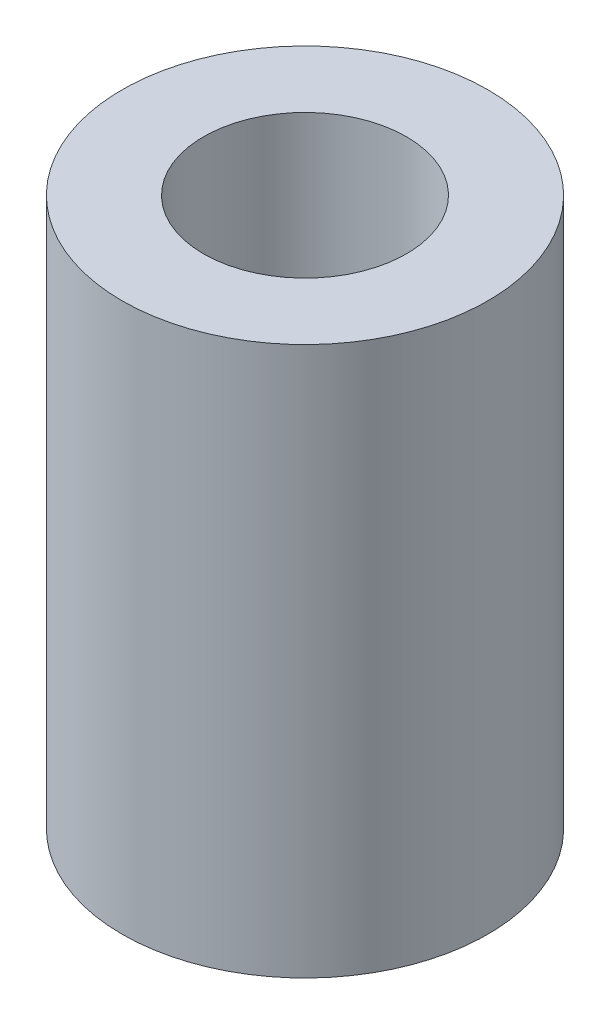
ISO-10303-21;
HEADER;
FILE_DESCRIPTION(('STEP AP214'),'2;1');
FILE_NAME('part.step','',(''),(''),'','','');
FILE_SCHEMA(('AUTOMOTIVE_DESIGN { 1 0 10303 214 1 1 1 1 }'));
ENDSEC;
DATA;
#1=APPLICATION_CONTEXT('core data for automotive mechanical design processes');
#2=APPLICATION_PROTOCOL_DEFINITION('international standard','automotive_design',2000,#1);
#3=PRODUCT_CONTEXT('',#1,'mechanical');
#4=PRODUCT('Part','Part','',(#3));
#5=PRODUCT_RELATED_PRODUCT_CATEGORY('part','',(#4));
#6=PRODUCT_DEFINITION_FORMATION('','',#4);
#7=PRODUCT_DEFINITION_CONTEXT('part definition',#1,'design');
#8=PRODUCT_DEFINITION('design','',#6,#7);
#9=PRODUCT_DEFINITION_SHAPE('','',#8);
#10=(LENGTH_UNIT() NAMED_UNIT(*) SI_UNIT(.MILLI.,.METRE.));
#11=(NAMED_UNIT(*) PLANE_ANGLE_UNIT() SI_UNIT($,.RADIAN.));
#12=(NAMED_UNIT(*) SI_UNIT($,.STERADIAN.) SOLID_ANGLE_UNIT());
#13=UNCERTAINTY_MEASURE_WITH_UNIT(LENGTH_MEASURE(1.E-05),#10,'distance_accuracy_value','');
#14=(GEOMETRIC_REPRESENTATION_CONTEXT(3) GLOBAL_UNCERTAINTY_ASSIGNED_CONTEXT((#13)) GLOBAL_UNIT_ASSIGNED_CONTEXT((#10,
#11,#12)) REPRESENTATION_CONTEXT('',''));
#15=CARTESIAN_POINT('',(0.,0.,0.));
#16=DIRECTION('',(0.,0.,1.));
#17=DIRECTION('',(1.,0.,0.));
#18=AXIS2_PLACEMENT_3D('',#15,#16,#17);
#19=CARTESIAN_POINT('',(0.,15.,0.));
#20=DIRECTION('',(0.,-1.,0.));
#21=DIRECTION('',(0.,0.,-1.));
#22=AXIS2_PLACEMENT_3D('',#19,#20,#21);
#23=CYLINDRICAL_SURFACE('',#22,10.);
#24=CARTESIAN_POINT('',(0.,0.,0.));
#25=DIRECTION('',(0.,1.,0.));
#26=DIRECTION('',(0.,0.,1.));
#27=AXIS2_PLACEMENT_3D('',#24,#25,#26);
#28=CIRCLE('',#27,10.);
#29=CARTESIAN_POINT('',(0.,0.,10.));
#30=VERTEX_POINT('',#29);
#31=EDGE_CURVE('E10',#30,#30,#28,.T.);
#32=ORIENTED_EDGE('',*,*,#31,.T.);
#33=EDGE_LOOP('',(#32));
#34=FACE_BOUND('',#33,.T.);
#35=CARTESIAN_POINT('',(0.,30.,0.));
#36=DIRECTION('',(0.,1.,0.));
#37=DIRECTION('',(0.,0.,1.));
#38=AXIS2_PLACEMENT_3D('',#35,#36,#37);
#39=CIRCLE('',#38,10.);
#40=CARTESIAN_POINT('',(0.,30.,10.));
#41=VERTEX_POINT('',#40);
#42=EDGE_CURVE('E70',#41,#41,#39,.T.);
#43=ORIENTED_EDGE('',*,*,#42,.F.);
#44=EDGE_LOOP('',(#43));
#45=FACE_BOUND('',#44,.T.);
#46=ADVANCED_FACE('F43',(#34,#45),#23,.T.);
#47=CARTESIAN_POINT('',(0.,0.,0.));
#48=DIRECTION('',(0.,1.,0.));
#49=DIRECTION('',(0.,0.,1.));
#50=AXIS2_PLACEMENT_3D('',#47,#48,#49);
#51=PLANE('',#50);
#52=CARTESIAN_POINT('',(0.,0.,0.));
#53=DIRECTION('',(0.,-1.,0.));
#54=DIRECTION('',(0.,0.,-1.));
#55=AXIS2_PLACEMENT_3D('',#52,#53,#54);
#56=CIRCLE('',#55,5.55);
#57=CARTESIAN_POINT('',(0.,0.,-5.55));
#58=VERTEX_POINT('',#57);
#59=EDGE_CURVE('E55',#58,#58,#56,.T.);
#60=ORIENTED_EDGE('',*,*,#59,.F.);
#61=EDGE_LOOP('',(#60));
#62=FACE_BOUND('',#61,.T.);
#63=ORIENTED_EDGE('',*,*,#31,.F.);
#64=EDGE_LOOP('',(#63));
#65=FACE_BOUND('',#64,.T.);
#66=ADVANCED_FACE('F121',(#62,#65),#51,.F.);
#67=CARTESIAN_POINT('',(0.,9.,0.));
#68=DIRECTION('',(0.,-1.,0.));
#69=DIRECTION('',(0.,0.,-1.));
#70=AXIS2_PLACEMENT_3D('',#67,#68,#69);
#71=CYLINDRICAL_SURFACE('',#70,5.55);
#72=CARTESIAN_POINT('',(0.,9.,0.));
#73=DIRECTION('',(0.,-1.,0.));
#74=DIRECTION('',(0.,0.,-1.));
#75=AXIS2_PLACEMENT_3D('',#72,#73,#74);
#76=CIRCLE('',#75,5.55);
#77=CARTESIAN_POINT('',(0.,9.,-5.55));
#78=VERTEX_POINT('',#77);
#79=EDGE_CURVE('E50',#78,#78,#76,.T.);
#80=ORIENTED_EDGE('',*,*,#79,.F.);
#81=EDGE_LOOP('',(#80));
#82=FACE_BOUND('',#81,.T.);
#83=ORIENTED_EDGE('',*,*,#59,.T.);
#84=EDGE_LOOP('',(#83));
#85=FACE_BOUND('',#84,.T.);
#86=ADVANCED_FACE('F115',(#82,#85),#71,.F.);
#87=CARTESIAN_POINT('',(0.,9.,0.));
#88=DIRECTION('',(0.,-1.,0.));
#89=DIRECTION('',(0.,0.,-1.));
#90=AXIS2_PLACEMENT_3D('',#87,#88,#89);
#91=PLANE('',#90);
#92=CARTESIAN_POINT('',(0.,9.,0.));
#93=DIRECTION('',(0.,-1.,0.));
#94=DIRECTION('',(0.,0.,-1.));
#95=AXIS2_PLACEMENT_3D('',#92,#93,#94);
#96=CIRCLE('',#95,4.2412880881695);
#97=CARTESIAN_POINT('',(0.,9.,-4.2412880881695));
#98=VERTEX_POINT('',#97);
#99=EDGE_CURVE('E66',#98,#98,#96,.T.);
#100=ORIENTED_EDGE('',*,*,#99,.F.);
#101=EDGE_LOOP('',(#100));
#102=FACE_BOUND('',#101,.T.);
#103=ORIENTED_EDGE('',*,*,#79,.T.);
#104=EDGE_LOOP('',(#103));
#105=FACE_BOUND('',#104,.T.);
#106=ADVANCED_FACE('F103',(#102,#105),#91,.T.);
#107=CARTESIAN_POINT('',(0.,15.,0.));
#108=DIRECTION('',(0.,-1.,0.));
#109=DIRECTION('',(0.,0.,-1.));
#110=AXIS2_PLACEMENT_3D('',#107,#108,#109);
#111=TOROIDAL_SURFACE('',#110,5.25,3.);
#112=CARTESIAN_POINT('',(0.,13.973939570023,0.));
#113=DIRECTION('',(0.,-1.,0.));
#114=DIRECTION('',(0.,0.,-1.));
#115=AXIS2_PLACEMENT_3D('',#112,#113,#114);
#116=CIRCLE('',#115,2.43092213764228);
#117=CARTESIAN_POINT('',(0.,13.973939570023,-2.43092213764228));
#118=VERTEX_POINT('',#117);
#119=EDGE_CURVE('E61',#118,#118,#116,.T.);
#120=ORIENTED_EDGE('',*,*,#119,.T.);
#121=EDGE_LOOP('',(#120));
#122=FACE_BOUND('',#121,.T.);
#123=CARTESIAN_POINT('',(0.,16.026060429977,0.));
#124=DIRECTION('',(0.,-1.,0.));
#125=DIRECTION('',(0.,0.,-1.));
#126=AXIS2_PLACEMENT_3D('',#123,#124,#125);
#127=CIRCLE('',#126,2.43092213764228);
#128=CARTESIAN_POINT('',(0.,16.026060429977,-2.43092213764228));
#129=VERTEX_POINT('',#128);
#130=EDGE_CURVE('E79',#129,#129,#127,.T.);
#131=ORIENTED_EDGE('',*,*,#130,.F.);
#132=EDGE_LOOP('',(#131));
#133=FACE_BOUND('',#132,.T.);
#134=ADVANCED_FACE('F100',(#122,#133),#111,.T.);
#135=CARTESIAN_POINT('',(0.,13.973939570023,0.));
#136=DIRECTION('',(0.,-1.,0.));
#137=DIRECTION('',(0.,0.,-1.));
#138=AXIS2_PLACEMENT_3D('',#135,#136,#137);
#139=CONICAL_SURFACE('',#138,2.43092213764228,0.34906585039887);
#140=ORIENTED_EDGE('',*,*,#99,.T.);
#141=EDGE_LOOP('',(#140));
#142=FACE_BOUND('',#141,.T.);
#143=ORIENTED_EDGE('',*,*,#119,.F.);
#144=EDGE_LOOP('',(#143));
#145=FACE_BOUND('',#144,.T.);
#146=ADVANCED_FACE('F102',(#142,#145),#139,.F.);
#147=CARTESIAN_POINT('',(0.,30.,0.));
#148=DIRECTION('',(0.,-1.,0.));
#149=DIRECTION('',(0.,0.,1.));
#150=AXIS2_PLACEMENT_3D('',#147,#148,#149);
#151=PLANE('',#150);
#152=CARTESIAN_POINT('',(0.,30.,0.));
#153=DIRECTION('',(0.,-1.,0.));
#154=DIRECTION('',(0.,0.,-1.));
#155=AXIS2_PLACEMENT_3D('',#152,#153,#154);
#156=CIRCLE('',#155,5.55);
#157=CARTESIAN_POINT('',(0.,30.,-5.55));
#158=VERTEX_POINT('',#157);
#159=EDGE_CURVE('E75',#158,#158,#156,.T.);
#160=ORIENTED_EDGE('',*,*,#159,.T.);
#161=EDGE_LOOP('',(#160));
#162=FACE_BOUND('',#161,.T.);
#163=ORIENTED_EDGE('',*,*,#42,.T.);
#164=EDGE_LOOP('',(#163));
#165=FACE_BOUND('',#164,.T.);
#166=ADVANCED_FACE('F106',(#162,#165),#151,.F.);
#167=CARTESIAN_POINT('',(0.,21.,0.));
#168=DIRECTION('',(0.,1.,0.));
#169=DIRECTION('',(0.,0.,1.));
#170=AXIS2_PLACEMENT_3D('',#167,#168,#169);
#171=CYLINDRICAL_SURFACE('',#170,5.55);
#172=CARTESIAN_POINT('',(0.,21.,0.));
#173=DIRECTION('',(0.,-1.,0.));
#174=DIRECTION('',(0.,0.,-1.));
#175=AXIS2_PLACEMENT_3D('',#172,#173,#174);
#176=CIRCLE('',#175,5.55);
#177=CARTESIAN_POINT('',(0.,21.,-5.55));
#178=VERTEX_POINT('',#177);
#179=EDGE_CURVE('E74',#178,#178,#176,.T.);
#180=ORIENTED_EDGE('',*,*,#179,.T.);
#181=EDGE_LOOP('',(#180));
#182=FACE_BOUND('',#181,.T.);
#183=ORIENTED_EDGE('',*,*,#159,.F.);
#184=EDGE_LOOP('',(#183));
#185=FACE_BOUND('',#184,.T.);
#186=ADVANCED_FACE('F118',(#182,#185),#171,.F.);
#187=CARTESIAN_POINT('',(0.,21.,0.));
#188=DIRECTION('',(0.,1.,0.));
#189=DIRECTION('',(0.,0.,-1.));
#190=AXIS2_PLACEMENT_3D('',#187,#188,#189);
#191=PLANE('',#190);
#192=CARTESIAN_POINT('',(0.,21.,0.));
#193=DIRECTION('',(0.,-1.,0.));
#194=DIRECTION('',(0.,0.,-1.));
#195=AXIS2_PLACEMENT_3D('',#192,#193,#194);
#196=CIRCLE('',#195,4.2412880881695);
#197=CARTESIAN_POINT('',(0.,21.,-4.2412880881695));
#198=VERTEX_POINT('',#197);
#199=EDGE_CURVE('E86',#198,#198,#196,.T.);
#200=ORIENTED_EDGE('',*,*,#199,.T.);
#201=EDGE_LOOP('',(#200));
#202=FACE_BOUND('',#201,.T.);
#203=ORIENTED_EDGE('',*,*,#179,.F.);
#204=EDGE_LOOP('',(#203));
#205=FACE_BOUND('',#204,.T.);
#206=ADVANCED_FACE('F91',(#202,#205),#191,.T.);
#207=CARTESIAN_POINT('',(0.,16.026060429977,0.));
#208=DIRECTION('',(0.,1.,0.));
#209=DIRECTION('',(0.,0.,-1.));
#210=AXIS2_PLACEMENT_3D('',#207,#208,#209);
#211=CONICAL_SURFACE('',#210,2.43092213764228,0.34906585039887);
#212=ORIENTED_EDGE('',*,*,#199,.F.);
#213=EDGE_LOOP('',(#212));
#214=FACE_BOUND('',#213,.T.);
#215=ORIENTED_EDGE('',*,*,#130,.T.);
#216=EDGE_LOOP('',(#215));
#217=FACE_BOUND('',#216,.T.);
#218=ADVANCED_FACE('F94',(#214,#217),#211,.F.);
#219=CLOSED_SHELL('',(#46,#66,#86,#106,#134,#146,#166,#186,#206,#218));
#220=MANIFOLD_SOLID_BREP('B2',#219);
#221=ADVANCED_BREP_SHAPE_REPRESENTATION('',(#18,#220),#14);
#222=SHAPE_DEFINITION_REPRESENTATION(#9,#221);
ENDSEC;
END-ISO-10303-21;
